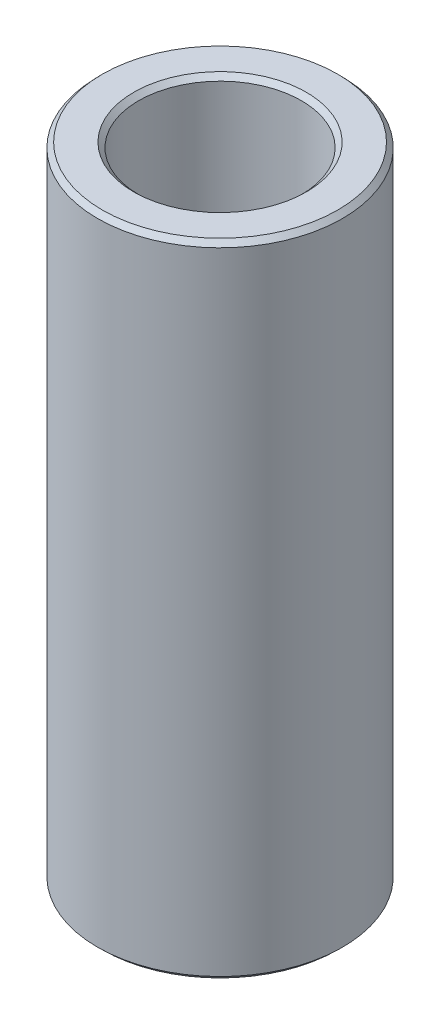
ISO-10303-21;
HEADER;
FILE_DESCRIPTION(('STEP AP214'),'2;1');
FILE_NAME('part.step','',(''),(''),'','','');
FILE_SCHEMA(('AUTOMOTIVE_DESIGN { 1 0 10303 214 1 1 1 1 }'));
ENDSEC;
DATA;
#1=APPLICATION_CONTEXT('core data for automotive mechanical design processes');
#2=APPLICATION_PROTOCOL_DEFINITION('international standard','automotive_design',2000,#1);
#3=PRODUCT_CONTEXT('',#1,'mechanical');
#4=PRODUCT('Part','Part','',(#3));
#5=PRODUCT_RELATED_PRODUCT_CATEGORY('part','',(#4));
#6=PRODUCT_DEFINITION_FORMATION('','',#4);
#7=PRODUCT_DEFINITION_CONTEXT('part definition',#1,'design');
#8=PRODUCT_DEFINITION('design','',#6,#7);
#9=PRODUCT_DEFINITION_SHAPE('','',#8);
#10=(LENGTH_UNIT() NAMED_UNIT(*) SI_UNIT(.MILLI.,.METRE.));
#11=(NAMED_UNIT(*) PLANE_ANGLE_UNIT() SI_UNIT($,.RADIAN.));
#12=(NAMED_UNIT(*) SI_UNIT($,.STERADIAN.) SOLID_ANGLE_UNIT());
#13=UNCERTAINTY_MEASURE_WITH_UNIT(LENGTH_MEASURE(1.E-05),#10,'distance_accuracy_value','');
#14=(GEOMETRIC_REPRESENTATION_CONTEXT(3) GLOBAL_UNCERTAINTY_ASSIGNED_CONTEXT((#13)) GLOBAL_UNIT_ASSIGNED_CONTEXT((#10,
#11,#12)) REPRESENTATION_CONTEXT('',''));
#15=CARTESIAN_POINT('',(0.,0.,0.));
#16=DIRECTION('',(0.,0.,1.));
#17=DIRECTION('',(1.,0.,0.));
#18=AXIS2_PLACEMENT_3D('',#15,#16,#17);
#19=CARTESIAN_POINT('',(0.,78.4854960761912,0.));
#20=DIRECTION('',(0.,-1.,0.));
#21=DIRECTION('',(0.,0.,-1.));
#22=AXIS2_PLACEMENT_3D('',#19,#20,#21);
#23=CYLINDRICAL_SURFACE('',#22,15.);
#24=CARTESIAN_POINT('',(0.,0.583933786185625,0.));
#25=DIRECTION('',(0.,1.,0.));
#26=DIRECTION('',(0.,0.,1.));
#27=AXIS2_PLACEMENT_3D('',#24,#25,#26);
#28=CIRCLE('',#27,15.);
#29=CARTESIAN_POINT('',(0.,0.583933786185625,15.));
#30=VERTEX_POINT('',#29);
#31=EDGE_CURVE('E10',#30,#30,#28,.T.);
#32=ORIENTED_EDGE('',*,*,#31,.T.);
#33=EDGE_LOOP('',(#32));
#34=FACE_BOUND('',#33,.T.);
#35=CARTESIAN_POINT('',(0.,77.87836874938,0.));
#36=DIRECTION('',(0.,1.,0.));
#37=DIRECTION('',(0.,0.,1.));
#38=AXIS2_PLACEMENT_3D('',#35,#36,#37);
#39=CIRCLE('',#38,15.);
#40=CARTESIAN_POINT('',(0.,77.87836874938,15.));
#41=VERTEX_POINT('',#40);
#42=EDGE_CURVE('E50',#41,#41,#39,.F.);
#43=ORIENTED_EDGE('',*,*,#42,.T.);
#44=EDGE_LOOP('',(#43));
#45=FACE_BOUND('',#44,.T.);
#46=ADVANCED_FACE('F39',(#34,#45),#23,.T.);
#47=CARTESIAN_POINT('',(0.,78.4854960761912,0.));
#48=DIRECTION('',(0.,1.,0.));
#49=DIRECTION('',(0.,0.,1.));
#50=AXIS2_PLACEMENT_3D('',#47,#48,#49);
#51=PLANE('',#50);
#52=CARTESIAN_POINT('',(0.,78.4854960761912,0.));
#53=DIRECTION('',(0.,1.,0.));
#54=DIRECTION('',(0.,0.,1.));
#55=AXIS2_PLACEMENT_3D('',#52,#53,#54);
#56=CIRCLE('',#55,10.5767661144514);
#57=CARTESIAN_POINT('',(0.,78.4854960761912,10.5767661144514));
#58=VERTEX_POINT('',#57);
#59=EDGE_CURVE('E58',#58,#58,#56,.F.);
#60=ORIENTED_EDGE('',*,*,#59,.T.);
#61=EDGE_LOOP('',(#60));
#62=FACE_BOUND('',#61,.T.);
#63=CARTESIAN_POINT('',(0.,78.4854960761912,0.));
#64=DIRECTION('',(0.,1.,0.));
#65=DIRECTION('',(0.,0.,1.));
#66=AXIS2_PLACEMENT_3D('',#63,#64,#65);
#67=CIRCLE('',#66,14.4160662138144);
#68=CARTESIAN_POINT('',(0.,78.4854960761912,14.4160662138144));
#69=VERTEX_POINT('',#68);
#70=EDGE_CURVE('E61',#69,#69,#67,.T.);
#71=ORIENTED_EDGE('',*,*,#70,.T.);
#72=EDGE_LOOP('',(#71));
#73=FACE_BOUND('',#72,.T.);
#74=ADVANCED_FACE('F88',(#62,#73),#51,.T.);
#75=CARTESIAN_POINT('',(0.,0.,0.));
#76=DIRECTION('',(0.,1.,0.));
#77=DIRECTION('',(0.,0.,1.));
#78=AXIS2_PLACEMENT_3D('',#75,#76,#77);
#79=PLANE('',#78);
#80=CARTESIAN_POINT('',(0.,0.,0.));
#81=DIRECTION('',(0.,1.,0.));
#82=DIRECTION('',(0.,0.,1.));
#83=AXIS2_PLACEMENT_3D('',#80,#81,#82);
#84=CIRCLE('',#83,10.5535725738258);
#85=CARTESIAN_POINT('',(0.,0.,10.5535725738258));
#86=VERTEX_POINT('',#85);
#87=EDGE_CURVE('E51',#86,#86,#84,.T.);
#88=ORIENTED_EDGE('',*,*,#87,.T.);
#89=EDGE_LOOP('',(#88));
#90=FACE_BOUND('',#89,.T.);
#91=CARTESIAN_POINT('',(0.,0.,0.));
#92=DIRECTION('',(0.,1.,0.));
#93=DIRECTION('',(0.,0.,1.));
#94=AXIS2_PLACEMENT_3D('',#91,#92,#93);
#95=CIRCLE('',#94,14.3928726731888);
#96=CARTESIAN_POINT('',(0.,0.,14.3928726731888));
#97=VERTEX_POINT('',#96);
#98=EDGE_CURVE('E54',#97,#97,#95,.F.);
#99=ORIENTED_EDGE('',*,*,#98,.T.);
#100=EDGE_LOOP('',(#99));
#101=FACE_BOUND('',#100,.T.);
#102=ADVANCED_FACE('F83',(#90,#101),#79,.F.);
#103=CARTESIAN_POINT('',(0.,78.4854960761912,0.));
#104=DIRECTION('',(0.,-1.,0.));
#105=DIRECTION('',(0.,0.,-1.));
#106=AXIS2_PLACEMENT_3D('',#103,#104,#105);
#107=CYLINDRICAL_SURFACE('',#106,9.96963878764013);
#108=CARTESIAN_POINT('',(0.,77.9015622900056,0.));
#109=DIRECTION('',(0.,1.,0.));
#110=DIRECTION('',(0.,0.,1.));
#111=AXIS2_PLACEMENT_3D('',#108,#109,#110);
#112=CIRCLE('',#111,9.96963878764013);
#113=CARTESIAN_POINT('',(0.,77.9015622900056,9.96963878764013));
#114=VERTEX_POINT('',#113);
#115=EDGE_CURVE('E67',#114,#114,#112,.T.);
#116=ORIENTED_EDGE('',*,*,#115,.T.);
#117=EDGE_LOOP('',(#116));
#118=FACE_BOUND('',#117,.T.);
#119=CARTESIAN_POINT('',(0.,0.607127326811258,0.));
#120=DIRECTION('',(0.,1.,0.));
#121=DIRECTION('',(0.,0.,1.));
#122=AXIS2_PLACEMENT_3D('',#119,#120,#121);
#123=CIRCLE('',#122,9.96963878764013);
#124=CARTESIAN_POINT('',(0.,0.607127326811258,9.96963878764013));
#125=VERTEX_POINT('',#124);
#126=EDGE_CURVE('E69',#125,#125,#123,.F.);
#127=ORIENTED_EDGE('',*,*,#126,.T.);
#128=EDGE_LOOP('',(#127));
#129=FACE_BOUND('',#128,.T.);
#130=ADVANCED_FACE('F71',(#118,#129),#107,.F.);
#131=CARTESIAN_POINT('',(0.,77.9015622900056,0.));
#132=DIRECTION('',(0.,1.,0.));
#133=DIRECTION('',(0.,0.,1.));
#134=AXIS2_PLACEMENT_3D('',#131,#132,#133);
#135=CONICAL_SURFACE('',#134,9.96963878764013,0.80486870893997);
#136=ORIENTED_EDGE('',*,*,#59,.F.);
#137=EDGE_LOOP('',(#136));
#138=FACE_BOUND('',#137,.T.);
#139=ORIENTED_EDGE('',*,*,#115,.F.);
#140=EDGE_LOOP('',(#139));
#141=FACE_BOUND('',#140,.T.);
#142=ADVANCED_FACE('F77',(#138,#141),#135,.F.);
#143=CARTESIAN_POINT('',(0.,0.,0.));
#144=DIRECTION('',(0.,-1.,0.));
#145=DIRECTION('',(0.,0.,-1.));
#146=AXIS2_PLACEMENT_3D('',#143,#144,#145);
#147=CONICAL_SURFACE('',#146,10.5535725738258,0.765927617854907);
#148=ORIENTED_EDGE('',*,*,#126,.F.);
#149=EDGE_LOOP('',(#148));
#150=FACE_BOUND('',#149,.T.);
#151=ORIENTED_EDGE('',*,*,#87,.F.);
#152=EDGE_LOOP('',(#151));
#153=FACE_BOUND('',#152,.T.);
#154=ADVANCED_FACE('F73',(#150,#153),#147,.F.);
#155=CARTESIAN_POINT('',(0.,0.583933786185625,0.));
#156=DIRECTION('',(0.,1.,0.));
#157=DIRECTION('',(0.,0.,1.));
#158=AXIS2_PLACEMENT_3D('',#155,#156,#157);
#159=CONICAL_SURFACE('',#158,15.,0.804868708939974);
#160=ORIENTED_EDGE('',*,*,#98,.F.);
#161=EDGE_LOOP('',(#160));
#162=FACE_BOUND('',#161,.T.);
#163=ORIENTED_EDGE('',*,*,#31,.F.);
#164=EDGE_LOOP('',(#163));
#165=FACE_BOUND('',#164,.T.);
#166=ADVANCED_FACE('F76',(#162,#165),#159,.T.);
#167=CARTESIAN_POINT('',(0.,78.4854960761912,0.));
#168=DIRECTION('',(0.,-1.,0.));
#169=DIRECTION('',(0.,0.,-1.));
#170=AXIS2_PLACEMENT_3D('',#167,#168,#169);
#171=CONICAL_SURFACE('',#170,14.4160662138144,0.765927617854917);
#172=ORIENTED_EDGE('',*,*,#42,.F.);
#173=EDGE_LOOP('',(#172));
#174=FACE_BOUND('',#173,.T.);
#175=ORIENTED_EDGE('',*,*,#70,.F.);
#176=EDGE_LOOP('',(#175));
#177=FACE_BOUND('',#176,.T.);
#178=ADVANCED_FACE('F45',(#174,#177),#171,.T.);
#179=CLOSED_SHELL('',(#46,#74,#102,#130,#142,#154,#166,#178));
#180=MANIFOLD_SOLID_BREP('B2',#179);
#181=ADVANCED_BREP_SHAPE_REPRESENTATION('',(#18,#180),#14);
#182=SHAPE_DEFINITION_REPRESENTATION(#9,#181);
ENDSEC;
END-ISO-10303-21;
